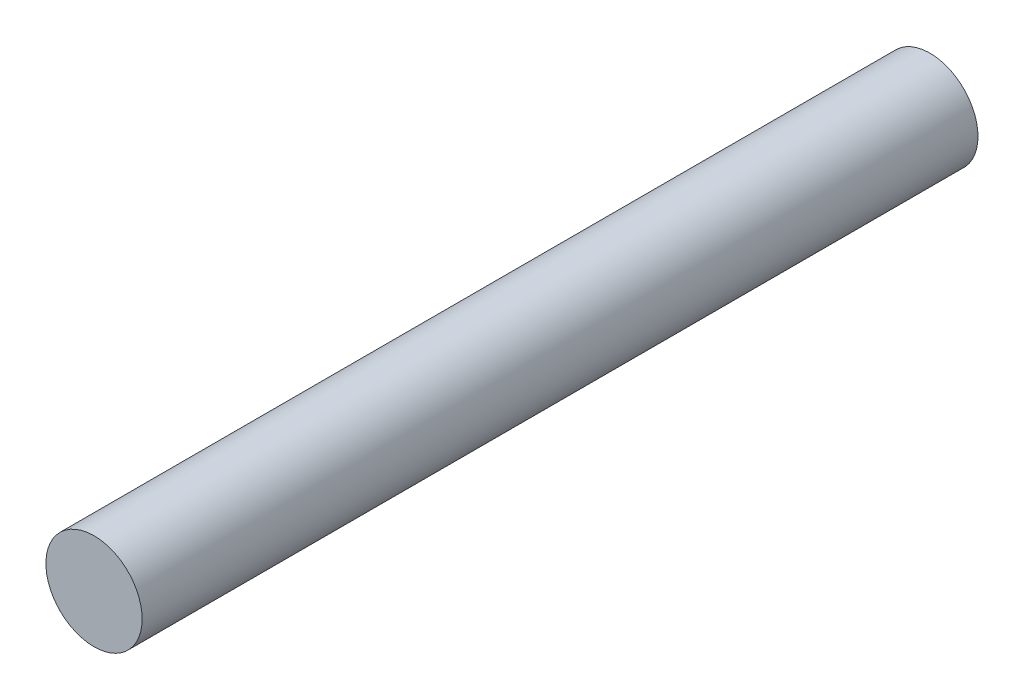
ISO-10303-21;
HEADER;
FILE_DESCRIPTION(('STEP AP214'),'2;1');
FILE_NAME('part.step','',(''),(''),'','','');
FILE_SCHEMA(('AUTOMOTIVE_DESIGN { 1 0 10303 214 1 1 1 1 }'));
ENDSEC;
DATA;
#1=APPLICATION_CONTEXT('core data for automotive mechanical design processes');
#2=APPLICATION_PROTOCOL_DEFINITION('international standard','automotive_design',2000,#1);
#3=PRODUCT_CONTEXT('',#1,'mechanical');
#4=PRODUCT('Part','Part','',(#3));
#5=PRODUCT_RELATED_PRODUCT_CATEGORY('part','',(#4));
#6=PRODUCT_DEFINITION_FORMATION('','',#4);
#7=PRODUCT_DEFINITION_CONTEXT('part definition',#1,'design');
#8=PRODUCT_DEFINITION('design','',#6,#7);
#9=PRODUCT_DEFINITION_SHAPE('','',#8);
#10=(LENGTH_UNIT() NAMED_UNIT(*) SI_UNIT(.MILLI.,.METRE.));
#11=(NAMED_UNIT(*) PLANE_ANGLE_UNIT() SI_UNIT($,.RADIAN.));
#12=(NAMED_UNIT(*) SI_UNIT($,.STERADIAN.) SOLID_ANGLE_UNIT());
#13=UNCERTAINTY_MEASURE_WITH_UNIT(LENGTH_MEASURE(1.E-05),#10,'distance_accuracy_value','');
#14=(GEOMETRIC_REPRESENTATION_CONTEXT(3) GLOBAL_UNCERTAINTY_ASSIGNED_CONTEXT((#13)) GLOBAL_UNIT_ASSIGNED_CONTEXT((#10,
#11,#12)) REPRESENTATION_CONTEXT('',''));
#15=CARTESIAN_POINT('',(0.,0.,0.));
#16=DIRECTION('',(0.,0.,1.));
#17=DIRECTION('',(1.,0.,0.));
#18=AXIS2_PLACEMENT_3D('',#15,#16,#17);
#19=CARTESIAN_POINT('',(0.,0.,69.5));
#20=DIRECTION('',(0.,0.,-1.));
#21=DIRECTION('',(-1.,0.,0.));
#22=AXIS2_PLACEMENT_3D('',#19,#20,#21);
#23=CYLINDRICAL_SURFACE('',#22,4.);
#24=CARTESIAN_POINT('',(0.,0.,69.5));
#25=DIRECTION('',(0.,0.,1.));
#26=DIRECTION('',(1.,0.,0.));
#27=AXIS2_PLACEMENT_3D('',#24,#25,#26);
#28=CIRCLE('',#27,4.);
#29=CARTESIAN_POINT('',(4.,0.,69.5));
#30=VERTEX_POINT('',#29);
#31=EDGE_CURVE('E10',#30,#30,#28,.T.);
#32=ORIENTED_EDGE('',*,*,#31,.F.);
#33=EDGE_LOOP('',(#32));
#34=FACE_BOUND('',#33,.T.);
#35=CARTESIAN_POINT('',(0.,0.,0.));
#36=DIRECTION('',(0.,0.,1.));
#37=DIRECTION('',(1.,0.,0.));
#38=AXIS2_PLACEMENT_3D('',#35,#36,#37);
#39=CIRCLE('',#38,4.);
#40=CARTESIAN_POINT('',(4.,0.,0.));
#41=VERTEX_POINT('',#40);
#42=EDGE_CURVE('E34',#41,#41,#39,.T.);
#43=ORIENTED_EDGE('',*,*,#42,.T.);
#44=EDGE_LOOP('',(#43));
#45=FACE_BOUND('',#44,.T.);
#46=ADVANCED_FACE('F31',(#34,#45),#23,.T.);
#47=CARTESIAN_POINT('',(0.,0.,69.5));
#48=DIRECTION('',(0.,0.,1.));
#49=DIRECTION('',(1.,0.,0.));
#50=AXIS2_PLACEMENT_3D('',#47,#48,#49);
#51=PLANE('',#50);
#52=ORIENTED_EDGE('',*,*,#31,.T.);
#53=EDGE_LOOP('',(#52));
#54=FACE_BOUND('',#53,.T.);
#55=ADVANCED_FACE('F46',(#54),#51,.T.);
#56=CARTESIAN_POINT('',(0.,0.,0.));
#57=DIRECTION('',(0.,0.,1.));
#58=DIRECTION('',(1.,0.,0.));
#59=AXIS2_PLACEMENT_3D('',#56,#57,#58);
#60=PLANE('',#59);
#61=ORIENTED_EDGE('',*,*,#42,.F.);
#62=EDGE_LOOP('',(#61));
#63=FACE_BOUND('',#62,.T.);
#64=ADVANCED_FACE('F44',(#63),#60,.F.);
#65=CLOSED_SHELL('',(#46,#55,#64));
#66=MANIFOLD_SOLID_BREP('B2',#65);
#67=ADVANCED_BREP_SHAPE_REPRESENTATION('',(#18,#66),#14);
#68=SHAPE_DEFINITION_REPRESENTATION(#9,#67);
ENDSEC;
END-ISO-10303-21;
